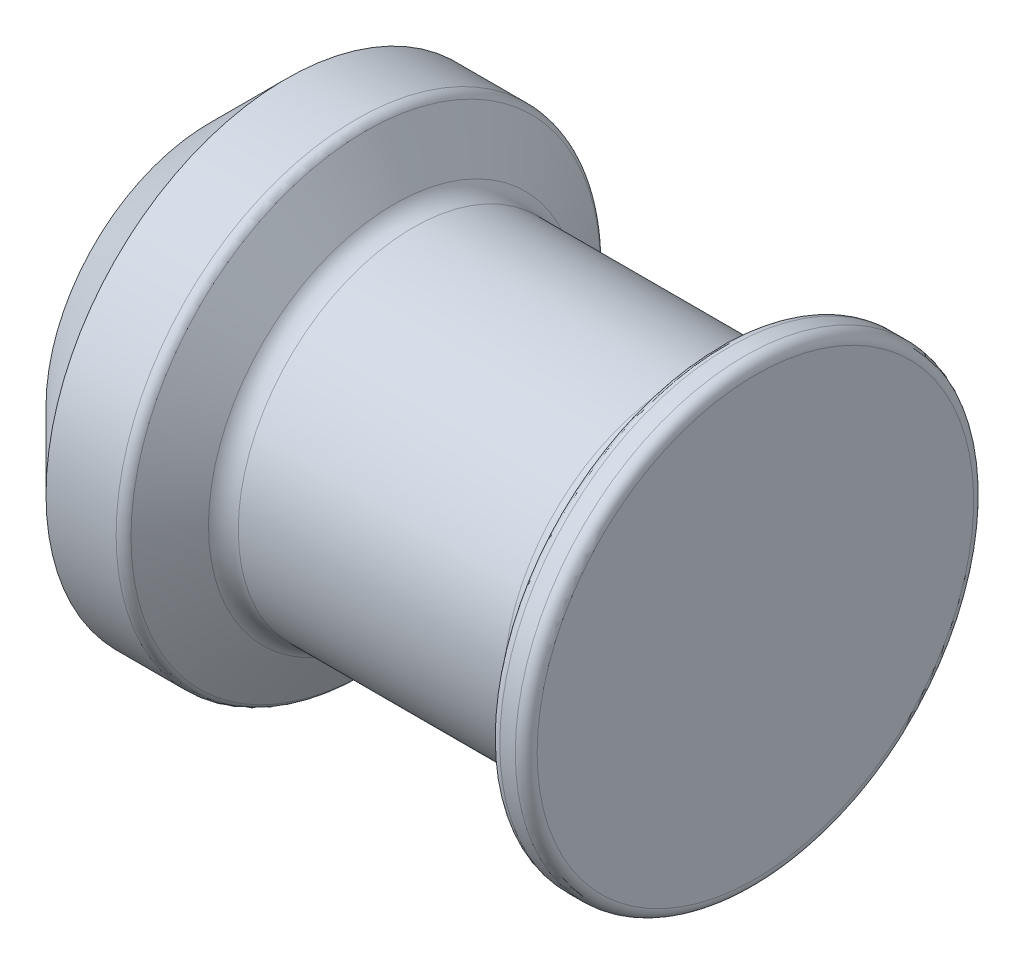
ISO-10303-21;
HEADER;
FILE_DESCRIPTION(('STEP AP214'),'2;1');
FILE_NAME('part.step','',(''),(''),'','','');
FILE_SCHEMA(('AUTOMOTIVE_DESIGN { 1 0 10303 214 1 1 1 1 }'));
ENDSEC;
DATA;
#1=APPLICATION_CONTEXT('core data for automotive mechanical design processes');
#2=APPLICATION_PROTOCOL_DEFINITION('international standard','automotive_design',2000,#1);
#3=PRODUCT_CONTEXT('',#1,'mechanical');
#4=PRODUCT('Part','Part','',(#3));
#5=PRODUCT_RELATED_PRODUCT_CATEGORY('part','',(#4));
#6=PRODUCT_DEFINITION_FORMATION('','',#4);
#7=PRODUCT_DEFINITION_CONTEXT('part definition',#1,'design');
#8=PRODUCT_DEFINITION('design','',#6,#7);
#9=PRODUCT_DEFINITION_SHAPE('','',#8);
#10=(LENGTH_UNIT() NAMED_UNIT(*) SI_UNIT(.MILLI.,.METRE.));
#11=(NAMED_UNIT(*) PLANE_ANGLE_UNIT() SI_UNIT($,.RADIAN.));
#12=(NAMED_UNIT(*) SI_UNIT($,.STERADIAN.) SOLID_ANGLE_UNIT());
#13=UNCERTAINTY_MEASURE_WITH_UNIT(LENGTH_MEASURE(1.E-05),#10,'distance_accuracy_value','');
#14=(GEOMETRIC_REPRESENTATION_CONTEXT(3) GLOBAL_UNCERTAINTY_ASSIGNED_CONTEXT((#13)) GLOBAL_UNIT_ASSIGNED_CONTEXT((#10,
#11,#12)) REPRESENTATION_CONTEXT('',''));
#15=CARTESIAN_POINT('',(0.,0.,0.));
#16=DIRECTION('',(0.,0.,1.));
#17=DIRECTION('',(1.,0.,0.));
#18=AXIS2_PLACEMENT_3D('',#15,#16,#17);
#19=CARTESIAN_POINT('',(50.,0.,0.));
#20=DIRECTION('',(-1.,0.,0.));
#21=DIRECTION('',(0.,0.,1.));
#22=AXIS2_PLACEMENT_3D('',#19,#20,#21);
#23=PLANE('',#22);
#24=CARTESIAN_POINT('',(50.,0.,0.));
#25=DIRECTION('',(-1.,0.,0.));
#26=DIRECTION('',(0.,0.,1.));
#27=AXIS2_PLACEMENT_3D('',#24,#25,#26);
#28=CIRCLE('',#27,20.);
#29=CARTESIAN_POINT('',(50.,0.,20.));
#30=VERTEX_POINT('',#29);
#31=EDGE_CURVE('E10',#30,#30,#28,.T.);
#32=ORIENTED_EDGE('',*,*,#31,.F.);
#33=EDGE_LOOP('',(#32));
#34=FACE_BOUND('',#33,.T.);
#35=ADVANCED_FACE('F37',(#34),#23,.F.);
#36=CARTESIAN_POINT('',(49.,0.,0.));
#37=DIRECTION('',(-1.,0.,0.));
#38=DIRECTION('',(0.,0.,1.));
#39=AXIS2_PLACEMENT_3D('',#36,#37,#38);
#40=TOROIDAL_SURFACE('',#39,20.,1.);
#41=CARTESIAN_POINT('',(49.,0.,0.));
#42=DIRECTION('',(-1.,0.,0.));
#43=DIRECTION('',(0.,0.,1.));
#44=AXIS2_PLACEMENT_3D('',#41,#42,#43);
#45=CIRCLE('',#44,21.);
#46=CARTESIAN_POINT('',(49.,0.,21.));
#47=VERTEX_POINT('',#46);
#48=EDGE_CURVE('E43',#47,#47,#45,.T.);
#49=ORIENTED_EDGE('',*,*,#48,.F.);
#50=EDGE_LOOP('',(#49));
#51=FACE_BOUND('',#50,.T.);
#52=ORIENTED_EDGE('',*,*,#31,.T.);
#53=EDGE_LOOP('',(#52));
#54=FACE_BOUND('',#53,.T.);
#55=ADVANCED_FACE('F139',(#51,#54),#40,.T.);
#56=CARTESIAN_POINT('',(0.,0.,0.));
#57=DIRECTION('',(-1.,0.,0.));
#58=DIRECTION('',(0.,0.,1.));
#59=AXIS2_PLACEMENT_3D('',#56,#57,#58);
#60=CYLINDRICAL_SURFACE('',#59,21.);
#61=CARTESIAN_POINT('',(47.5773502691896,0.,0.));
#62=DIRECTION('',(-1.,0.,0.));
#63=DIRECTION('',(0.,0.,1.));
#64=AXIS2_PLACEMENT_3D('',#61,#62,#63);
#65=CIRCLE('',#64,21.);
#66=CARTESIAN_POINT('',(47.5773502691896,0.,21.));
#67=VERTEX_POINT('',#66);
#68=EDGE_CURVE('E47',#67,#67,#65,.T.);
#69=ORIENTED_EDGE('',*,*,#68,.F.);
#70=EDGE_LOOP('',(#69));
#71=FACE_BOUND('',#70,.T.);
#72=ORIENTED_EDGE('',*,*,#48,.T.);
#73=EDGE_LOOP('',(#72));
#74=FACE_BOUND('',#73,.T.);
#75=ADVANCED_FACE('F134',(#71,#74),#60,.T.);
#76=CARTESIAN_POINT('',(47.5773502691896,0.,0.));
#77=DIRECTION('',(-1.,0.,0.));
#78=DIRECTION('',(0.,0.,1.));
#79=AXIS2_PLACEMENT_3D('',#76,#77,#78);
#80=TOROIDAL_SURFACE('',#79,20.,1.);
#81=CARTESIAN_POINT('',(46.7113248654052,0.,0.));
#82=DIRECTION('',(-1.,0.,0.));
#83=DIRECTION('',(0.,0.,1.));
#84=AXIS2_PLACEMENT_3D('',#81,#82,#83);
#85=CIRCLE('',#84,20.5);
#86=CARTESIAN_POINT('',(46.7113248654052,0.,20.5));
#87=VERTEX_POINT('',#86);
#88=EDGE_CURVE('E51',#87,#87,#85,.T.);
#89=ORIENTED_EDGE('',*,*,#88,.F.);
#90=EDGE_LOOP('',(#89));
#91=FACE_BOUND('',#90,.T.);
#92=ORIENTED_EDGE('',*,*,#68,.T.);
#93=EDGE_LOOP('',(#92));
#94=FACE_BOUND('',#93,.T.);
#95=ADVANCED_FACE('F128',(#91,#94),#80,.T.);
#96=CARTESIAN_POINT('',(46.7113248654052,0.,0.));
#97=DIRECTION('',(1.,0.,0.));
#98=DIRECTION('',(0.,0.,-1.));
#99=AXIS2_PLACEMENT_3D('',#96,#97,#98);
#100=CONICAL_SURFACE('',#99,20.5,1.0471975511966);
#101=CARTESIAN_POINT('',(44.6905989232415,0.,0.));
#102=DIRECTION('',(-1.,0.,0.));
#103=DIRECTION('',(0.,0.,1.));
#104=AXIS2_PLACEMENT_3D('',#101,#102,#103);
#105=CIRCLE('',#104,17.);
#106=CARTESIAN_POINT('',(44.6905989232415,0.,17.));
#107=VERTEX_POINT('',#106);
#108=EDGE_CURVE('E56',#107,#107,#105,.T.);
#109=ORIENTED_EDGE('',*,*,#108,.F.);
#110=EDGE_LOOP('',(#109));
#111=FACE_BOUND('',#110,.T.);
#112=ORIENTED_EDGE('',*,*,#88,.T.);
#113=EDGE_LOOP('',(#112));
#114=FACE_BOUND('',#113,.T.);
#115=ADVANCED_FACE('F122',(#111,#114),#100,.T.);
#116=CARTESIAN_POINT('',(42.9585481156726,0.,0.));
#117=DIRECTION('',(-1.,0.,0.));
#118=DIRECTION('',(0.,0.,1.));
#119=AXIS2_PLACEMENT_3D('',#116,#117,#118);
#120=TOROIDAL_SURFACE('',#119,18.,2.);
#121=CARTESIAN_POINT('',(42.9585481156726,0.,0.));
#122=DIRECTION('',(-1.,0.,0.));
#123=DIRECTION('',(0.,0.,1.));
#124=AXIS2_PLACEMENT_3D('',#121,#122,#123);
#125=CIRCLE('',#124,16.);
#126=CARTESIAN_POINT('',(42.9585481156726,0.,16.));
#127=VERTEX_POINT('',#126);
#128=EDGE_CURVE('E59',#127,#127,#125,.T.);
#129=ORIENTED_EDGE('',*,*,#128,.F.);
#130=EDGE_LOOP('',(#129));
#131=FACE_BOUND('',#130,.T.);
#132=ORIENTED_EDGE('',*,*,#108,.T.);
#133=EDGE_LOOP('',(#132));
#134=FACE_BOUND('',#133,.T.);
#135=ADVANCED_FACE('F116',(#131,#134),#120,.F.);
#136=CARTESIAN_POINT('',(0.,0.,0.));
#137=DIRECTION('',(-1.,0.,0.));
#138=DIRECTION('',(0.,0.,1.));
#139=AXIS2_PLACEMENT_3D('',#136,#137,#138);
#140=CYLINDRICAL_SURFACE('',#139,16.);
#141=CARTESIAN_POINT('',(18.618802153517,0.,0.));
#142=DIRECTION('',(-1.,0.,0.));
#143=DIRECTION('',(0.,0.,1.));
#144=AXIS2_PLACEMENT_3D('',#141,#142,#143);
#145=CIRCLE('',#144,16.);
#146=CARTESIAN_POINT('',(18.618802153517,0.,16.));
#147=VERTEX_POINT('',#146);
#148=EDGE_CURVE('E62',#147,#147,#145,.T.);
#149=ORIENTED_EDGE('',*,*,#148,.F.);
#150=EDGE_LOOP('',(#149));
#151=FACE_BOUND('',#150,.T.);
#152=ORIENTED_EDGE('',*,*,#128,.T.);
#153=EDGE_LOOP('',(#152));
#154=FACE_BOUND('',#153,.T.);
#155=ADVANCED_FACE('F110',(#151,#154),#140,.T.);
#156=CARTESIAN_POINT('',(18.618802153517,0.,0.));
#157=DIRECTION('',(-1.,0.,0.));
#158=DIRECTION('',(0.,0.,1.));
#159=AXIS2_PLACEMENT_3D('',#156,#157,#158);
#160=TOROIDAL_SURFACE('',#159,18.,2.);
#161=CARTESIAN_POINT('',(16.8867513459481,0.,0.));
#162=DIRECTION('',(-1.,0.,0.));
#163=DIRECTION('',(0.,0.,1.));
#164=AXIS2_PLACEMENT_3D('',#161,#162,#163);
#165=CIRCLE('',#164,17.);
#166=CARTESIAN_POINT('',(16.8867513459481,0.,17.));
#167=VERTEX_POINT('',#166);
#168=EDGE_CURVE('E65',#167,#167,#165,.T.);
#169=ORIENTED_EDGE('',*,*,#168,.F.);
#170=EDGE_LOOP('',(#169));
#171=FACE_BOUND('',#170,.T.);
#172=ORIENTED_EDGE('',*,*,#148,.T.);
#173=EDGE_LOOP('',(#172));
#174=FACE_BOUND('',#173,.T.);
#175=ADVANCED_FACE('F104',(#171,#174),#160,.F.);
#176=CARTESIAN_POINT('',(16.8867513459481,0.,0.));
#177=DIRECTION('',(-1.,0.,0.));
#178=DIRECTION('',(0.,0.,1.));
#179=AXIS2_PLACEMENT_3D('',#176,#177,#178);
#180=CONICAL_SURFACE('',#179,17.,1.0471975511966);
#181=CARTESIAN_POINT('',(14.2886751345948,0.,0.));
#182=DIRECTION('',(-1.,0.,0.));
#183=DIRECTION('',(0.,0.,1.));
#184=AXIS2_PLACEMENT_3D('',#181,#182,#183);
#185=CIRCLE('',#184,21.5);
#186=CARTESIAN_POINT('',(14.2886751345948,0.,21.5));
#187=VERTEX_POINT('',#186);
#188=EDGE_CURVE('E68',#187,#187,#185,.T.);
#189=ORIENTED_EDGE('',*,*,#188,.F.);
#190=EDGE_LOOP('',(#189));
#191=FACE_BOUND('',#190,.T.);
#192=ORIENTED_EDGE('',*,*,#168,.T.);
#193=EDGE_LOOP('',(#192));
#194=FACE_BOUND('',#193,.T.);
#195=ADVANCED_FACE('F98',(#191,#194),#180,.T.);
#196=CARTESIAN_POINT('',(13.4226497308104,0.,0.));
#197=DIRECTION('',(-1.,0.,0.));
#198=DIRECTION('',(0.,0.,1.));
#199=AXIS2_PLACEMENT_3D('',#196,#197,#198);
#200=TOROIDAL_SURFACE('',#199,21.,1.);
#201=CARTESIAN_POINT('',(13.4226497308104,0.,0.));
#202=DIRECTION('',(-1.,0.,0.));
#203=DIRECTION('',(0.,0.,1.));
#204=AXIS2_PLACEMENT_3D('',#201,#202,#203);
#205=CIRCLE('',#204,22.);
#206=CARTESIAN_POINT('',(13.4226497308104,0.,22.));
#207=VERTEX_POINT('',#206);
#208=EDGE_CURVE('E71',#207,#207,#205,.T.);
#209=ORIENTED_EDGE('',*,*,#208,.F.);
#210=EDGE_LOOP('',(#209));
#211=FACE_BOUND('',#210,.T.);
#212=ORIENTED_EDGE('',*,*,#188,.T.);
#213=EDGE_LOOP('',(#212));
#214=FACE_BOUND('',#213,.T.);
#215=ADVANCED_FACE('F92',(#211,#214),#200,.T.);
#216=CARTESIAN_POINT('',(0.,0.,0.));
#217=DIRECTION('',(-1.,0.,0.));
#218=DIRECTION('',(0.,0.,1.));
#219=AXIS2_PLACEMENT_3D('',#216,#217,#218);
#220=CYLINDRICAL_SURFACE('',#219,22.);
#221=CARTESIAN_POINT('',(7.,0.,0.));
#222=DIRECTION('',(-1.,0.,0.));
#223=DIRECTION('',(0.,0.,1.));
#224=AXIS2_PLACEMENT_3D('',#221,#222,#223);
#225=CIRCLE('',#224,22.);
#226=CARTESIAN_POINT('',(7.,0.,22.));
#227=VERTEX_POINT('',#226);
#228=EDGE_CURVE('E74',#227,#227,#225,.T.);
#229=ORIENTED_EDGE('',*,*,#228,.F.);
#230=EDGE_LOOP('',(#229));
#231=FACE_BOUND('',#230,.T.);
#232=ORIENTED_EDGE('',*,*,#208,.T.);
#233=EDGE_LOOP('',(#232));
#234=FACE_BOUND('',#233,.T.);
#235=ADVANCED_FACE('F86',(#231,#234),#220,.T.);
#236=CARTESIAN_POINT('',(7.,0.,0.));
#237=DIRECTION('',(1.,0.,0.));
#238=DIRECTION('',(0.,0.,-1.));
#239=AXIS2_PLACEMENT_3D('',#236,#237,#238);
#240=CONICAL_SURFACE('',#239,22.,0.785398163397447);
#241=CARTESIAN_POINT('',(0.,0.,0.));
#242=DIRECTION('',(-1.,0.,0.));
#243=DIRECTION('',(0.,0.,1.));
#244=AXIS2_PLACEMENT_3D('',#241,#242,#243);
#245=CIRCLE('',#244,15.);
#246=CARTESIAN_POINT('',(0.,0.,15.));
#247=VERTEX_POINT('',#246);
#248=EDGE_CURVE('E77',#247,#247,#245,.T.);
#249=ORIENTED_EDGE('',*,*,#248,.F.);
#250=EDGE_LOOP('',(#249));
#251=FACE_BOUND('',#250,.T.);
#252=ORIENTED_EDGE('',*,*,#228,.T.);
#253=EDGE_LOOP('',(#252));
#254=FACE_BOUND('',#253,.T.);
#255=ADVANCED_FACE('F83',(#251,#254),#240,.T.);
#256=CARTESIAN_POINT('',(0.,15.,0.));
#257=DIRECTION('',(1.,0.,0.));
#258=DIRECTION('',(0.,0.,-1.));
#259=AXIS2_PLACEMENT_3D('',#256,#257,#258);
#260=PLANE('',#259);
#261=ORIENTED_EDGE('',*,*,#248,.T.);
#262=EDGE_LOOP('',(#261));
#263=FACE_BOUND('',#262,.T.);
#264=ADVANCED_FACE('F81',(#263),#260,.F.);
#265=CLOSED_SHELL('',(#35,#55,#75,#95,#115,#135,#155,#175,#195,#215,#235,#255,#264));
#266=MANIFOLD_SOLID_BREP('B2',#265);
#267=ADVANCED_BREP_SHAPE_REPRESENTATION('',(#18,#266),#14);
#268=SHAPE_DEFINITION_REPRESENTATION(#9,#267);
ENDSEC;
END-ISO-10303-21;
